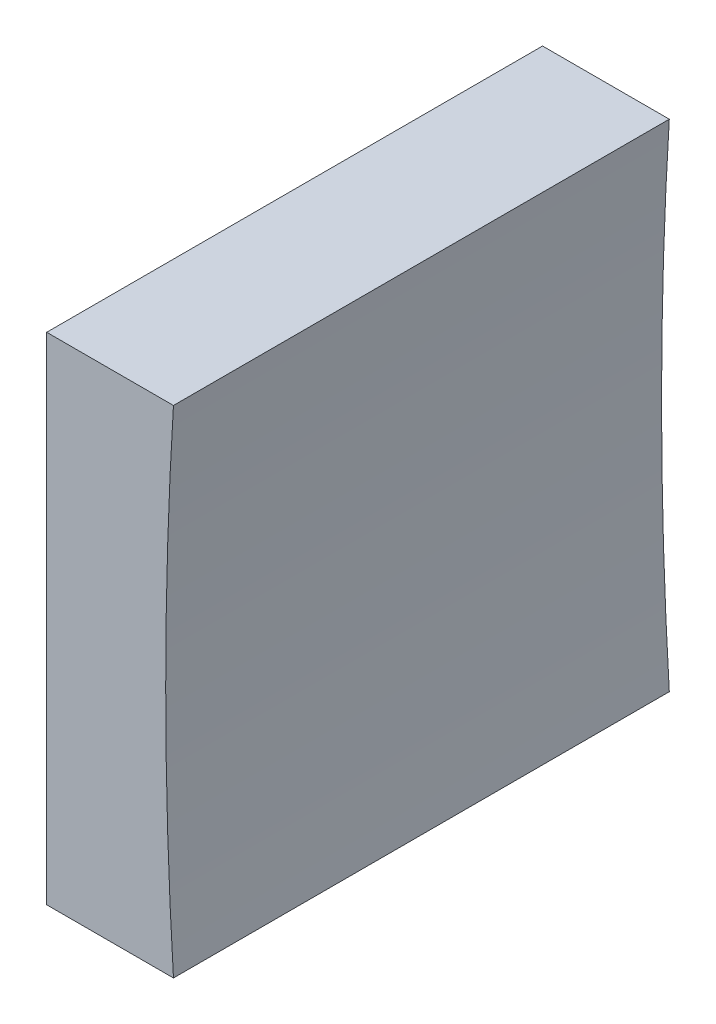
ISO-10303-21;
HEADER;
FILE_DESCRIPTION(('STEP AP214'),'2;1');
FILE_NAME('part.step','',(''),(''),'','','');
FILE_SCHEMA(('AUTOMOTIVE_DESIGN { 1 0 10303 214 1 1 1 1 }'));
ENDSEC;
DATA;
#1=APPLICATION_CONTEXT('core data for automotive mechanical design processes');
#2=APPLICATION_PROTOCOL_DEFINITION('international standard','automotive_design',2000,#1);
#3=PRODUCT_CONTEXT('',#1,'mechanical');
#4=PRODUCT('Part','Part','',(#3));
#5=PRODUCT_RELATED_PRODUCT_CATEGORY('part','',(#4));
#6=PRODUCT_DEFINITION_FORMATION('','',#4);
#7=PRODUCT_DEFINITION_CONTEXT('part definition',#1,'design');
#8=PRODUCT_DEFINITION('design','',#6,#7);
#9=PRODUCT_DEFINITION_SHAPE('','',#8);
#10=(LENGTH_UNIT() NAMED_UNIT(*) SI_UNIT(.MILLI.,.METRE.));
#11=(NAMED_UNIT(*) PLANE_ANGLE_UNIT() SI_UNIT($,.RADIAN.));
#12=(NAMED_UNIT(*) SI_UNIT($,.STERADIAN.) SOLID_ANGLE_UNIT());
#13=UNCERTAINTY_MEASURE_WITH_UNIT(LENGTH_MEASURE(1.E-05),#10,'distance_accuracy_value','');
#14=(GEOMETRIC_REPRESENTATION_CONTEXT(3) GLOBAL_UNCERTAINTY_ASSIGNED_CONTEXT((#13)) GLOBAL_UNIT_ASSIGNED_CONTEXT((#10,
#11,#12)) REPRESENTATION_CONTEXT('',''));
#15=CARTESIAN_POINT('',(0.,0.,0.));
#16=DIRECTION('',(0.,0.,1.));
#17=DIRECTION('',(1.,0.,0.));
#18=AXIS2_PLACEMENT_3D('',#15,#16,#17);
#19=CARTESIAN_POINT('',(291.098142847889,54.3579292677671,25.));
#20=DIRECTION('',(0.,1.,0.));
#21=DIRECTION('',(-1.,0.,0.));
#22=AXIS2_PLACEMENT_3D('',#19,#20,#21);
#23=PLANE('',#22);
#24=DIRECTION('',(1.,0.,0.));
#25=VECTOR('',#24,1.);
#26=CARTESIAN_POINT('',(291.098142847889,54.3579292677671,0.));
#27=LINE('',#26,#25);
#28=CARTESIAN_POINT('',(284.707135631282,54.3579292677671,0.));
#29=VERTEX_POINT('',#28);
#30=CARTESIAN_POINT('',(291.098142847889,54.3579292677672,0.));
#31=VERTEX_POINT('',#30);
#32=EDGE_CURVE('E91',#29,#31,#27,.T.);
#33=ORIENTED_EDGE('',*,*,#32,.T.);
#34=DIRECTION('',(0.,0.,-1.));
#35=VECTOR('',#34,1.);
#36=CARTESIAN_POINT('',(291.098142847889,54.3579292677672,25.));
#37=LINE('',#36,#35);
#38=CARTESIAN_POINT('',(291.098142847889,54.3579292677672,25.));
#39=VERTEX_POINT('',#38);
#40=EDGE_CURVE('E45',#39,#31,#37,.T.);
#41=ORIENTED_EDGE('',*,*,#40,.F.);
#42=DIRECTION('',(1.,0.,0.));
#43=VECTOR('',#42,1.);
#44=CARTESIAN_POINT('',(291.098142847889,54.3579292677671,25.));
#45=LINE('',#44,#43);
#46=CARTESIAN_POINT('',(284.707135631282,54.3579292677671,25.));
#47=VERTEX_POINT('',#46);
#48=EDGE_CURVE('E84',#47,#39,#45,.T.);
#49=ORIENTED_EDGE('',*,*,#48,.F.);
#50=DIRECTION('',(0.,0.,-1.));
#51=VECTOR('',#50,1.);
#52=CARTESIAN_POINT('',(284.707135631282,54.3579292677671,25.));
#53=LINE('',#52,#51);
#54=EDGE_CURVE('E11',#47,#29,#53,.T.);
#55=ORIENTED_EDGE('',*,*,#54,.T.);
#56=EDGE_LOOP('',(#33,#41,#49,#55));
#57=FACE_BOUND('',#56,.T.);
#58=ADVANCED_FACE('F37',(#57),#23,.F.);
#59=CARTESIAN_POINT('',(490.70713563128,66.8579292677671,25.));
#60=DIRECTION('',(0.,0.,-1.));
#61=DIRECTION('',(-1.,0.,0.));
#62=AXIS2_PLACEMENT_3D('',#59,#60,#61);
#63=CYLINDRICAL_SURFACE('',#62,200.);
#64=CARTESIAN_POINT('',(490.70713563128,66.8579292677671,0.));
#65=DIRECTION('',(0.,0.,-1.));
#66=DIRECTION('',(1.,0.,0.));
#67=AXIS2_PLACEMENT_3D('',#64,#65,#66);
#68=CIRCLE('',#67,200.);
#69=CARTESIAN_POINT('',(291.098142847889,79.3579292677671,0.));
#70=VERTEX_POINT('',#69);
#71=EDGE_CURVE('E71',#31,#70,#68,.T.);
#72=ORIENTED_EDGE('',*,*,#71,.T.);
#73=DIRECTION('',(0.,0.,-1.));
#74=VECTOR('',#73,1.);
#75=CARTESIAN_POINT('',(291.098142847889,79.3579292677671,25.));
#76=LINE('',#75,#74);
#77=CARTESIAN_POINT('',(291.098142847889,79.3579292677671,25.));
#78=VERTEX_POINT('',#77);
#79=EDGE_CURVE('E92',#78,#70,#76,.T.);
#80=ORIENTED_EDGE('',*,*,#79,.F.);
#81=CARTESIAN_POINT('',(490.70713563128,66.8579292677671,25.));
#82=DIRECTION('',(0.,0.,-1.));
#83=DIRECTION('',(1.,0.,0.));
#84=AXIS2_PLACEMENT_3D('',#81,#82,#83);
#85=CIRCLE('',#84,200.);
#86=EDGE_CURVE('E88',#39,#78,#85,.T.);
#87=ORIENTED_EDGE('',*,*,#86,.F.);
#88=ORIENTED_EDGE('',*,*,#40,.T.);
#89=EDGE_LOOP('',(#72,#80,#87,#88));
#90=FACE_BOUND('',#89,.T.);
#91=ADVANCED_FACE('F93',(#90),#63,.F.);
#92=CARTESIAN_POINT('',(284.707135631282,79.3579292677671,25.));
#93=DIRECTION('',(0.,-1.,0.));
#94=DIRECTION('',(0.,0.,-1.));
#95=AXIS2_PLACEMENT_3D('',#92,#93,#94);
#96=PLANE('',#95);
#97=DIRECTION('',(-1.,0.,0.));
#98=VECTOR('',#97,1.);
#99=CARTESIAN_POINT('',(284.707135631282,79.3579292677671,0.));
#100=LINE('',#99,#98);
#101=CARTESIAN_POINT('',(284.707135631282,79.3579292677671,0.));
#102=VERTEX_POINT('',#101);
#103=EDGE_CURVE('E78',#70,#102,#100,.T.);
#104=ORIENTED_EDGE('',*,*,#103,.T.);
#105=DIRECTION('',(0.,0.,-1.));
#106=VECTOR('',#105,1.);
#107=CARTESIAN_POINT('',(284.707135631282,79.3579292677671,25.));
#108=LINE('',#107,#106);
#109=CARTESIAN_POINT('',(284.707135631282,79.3579292677671,25.));
#110=VERTEX_POINT('',#109);
#111=EDGE_CURVE('E97',#110,#102,#108,.T.);
#112=ORIENTED_EDGE('',*,*,#111,.F.);
#113=DIRECTION('',(-1.,0.,0.));
#114=VECTOR('',#113,1.);
#115=CARTESIAN_POINT('',(284.707135631282,79.3579292677671,25.));
#116=LINE('',#115,#114);
#117=EDGE_CURVE('E95',#78,#110,#116,.T.);
#118=ORIENTED_EDGE('',*,*,#117,.F.);
#119=ORIENTED_EDGE('',*,*,#79,.T.);
#120=EDGE_LOOP('',(#104,#112,#118,#119));
#121=FACE_BOUND('',#120,.T.);
#122=ADVANCED_FACE('F107',(#121),#96,.F.);
#123=CARTESIAN_POINT('',(284.707135631282,66.8579292677671,25.));
#124=DIRECTION('',(1.,0.,0.));
#125=DIRECTION('',(0.,0.,-1.));
#126=AXIS2_PLACEMENT_3D('',#123,#124,#125);
#127=PLANE('',#126);
#128=DIRECTION('',(0.,-1.,0.));
#129=VECTOR('',#128,1.);
#130=CARTESIAN_POINT('',(284.707135631282,66.8579292677671,0.));
#131=LINE('',#130,#129);
#132=EDGE_CURVE('E104',#102,#29,#131,.T.);
#133=ORIENTED_EDGE('',*,*,#132,.T.);
#134=ORIENTED_EDGE('',*,*,#54,.F.);
#135=DIRECTION('',(0.,-1.,0.));
#136=VECTOR('',#135,1.);
#137=CARTESIAN_POINT('',(284.707135631282,54.3579292677671,25.));
#138=LINE('',#137,#136);
#139=EDGE_CURVE('E53',#110,#47,#138,.T.);
#140=ORIENTED_EDGE('',*,*,#139,.F.);
#141=ORIENTED_EDGE('',*,*,#111,.T.);
#142=EDGE_LOOP('',(#133,#134,#140,#141));
#143=FACE_BOUND('',#142,.T.);
#144=ADVANCED_FACE('F111',(#143),#127,.F.);
#145=CARTESIAN_POINT('',(490.70713563128,66.8579292677671,25.));
#146=DIRECTION('',(0.,0.,1.));
#147=DIRECTION('',(1.,0.,0.));
#148=AXIS2_PLACEMENT_3D('',#145,#146,#147);
#149=PLANE('',#148);
#150=ORIENTED_EDGE('',*,*,#139,.T.);
#151=ORIENTED_EDGE('',*,*,#48,.T.);
#152=ORIENTED_EDGE('',*,*,#86,.T.);
#153=ORIENTED_EDGE('',*,*,#117,.T.);
#154=EDGE_LOOP('',(#150,#151,#152,#153));
#155=FACE_BOUND('',#154,.T.);
#156=ADVANCED_FACE('F86',(#155),#149,.T.);
#157=CARTESIAN_POINT('',(490.70713563128,66.8579292677671,0.));
#158=DIRECTION('',(0.,0.,1.));
#159=DIRECTION('',(1.,0.,0.));
#160=AXIS2_PLACEMENT_3D('',#157,#158,#159);
#161=PLANE('',#160);
#162=ORIENTED_EDGE('',*,*,#32,.F.);
#163=ORIENTED_EDGE('',*,*,#132,.F.);
#164=ORIENTED_EDGE('',*,*,#103,.F.);
#165=ORIENTED_EDGE('',*,*,#71,.F.);
#166=EDGE_LOOP('',(#162,#163,#164,#165));
#167=FACE_BOUND('',#166,.T.);
#168=ADVANCED_FACE('F110',(#167),#161,.F.);
#169=CLOSED_SHELL('',(#58,#91,#122,#144,#156,#168));
#170=MANIFOLD_SOLID_BREP('B2',#169);
#171=ADVANCED_BREP_SHAPE_REPRESENTATION('',(#18,#170),#14);
#172=SHAPE_DEFINITION_REPRESENTATION(#9,#171);
ENDSEC;
END-ISO-10303-21;
